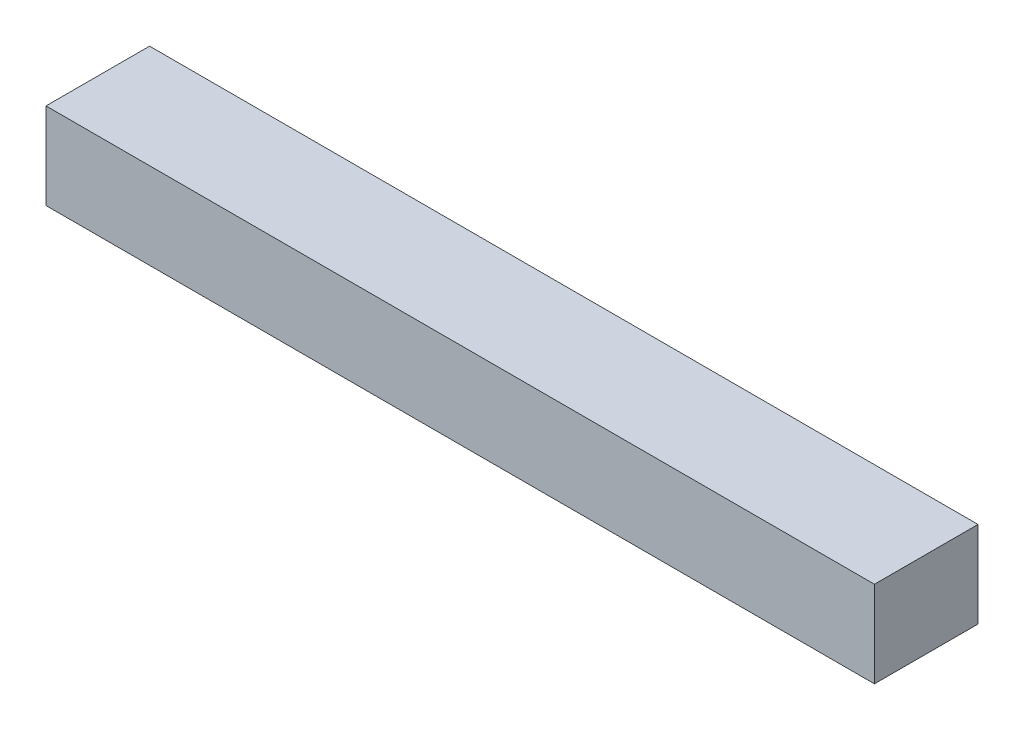
ISO-10303-21;
HEADER;
FILE_DESCRIPTION(('STEP AP214'),'2;1');
FILE_NAME('part.step','',(''),(''),'','','');
FILE_SCHEMA(('AUTOMOTIVE_DESIGN { 1 0 10303 214 1 1 1 1 }'));
ENDSEC;
DATA;
#1=APPLICATION_CONTEXT('core data for automotive mechanical design processes');
#2=APPLICATION_PROTOCOL_DEFINITION('international standard','automotive_design',2000,#1);
#3=PRODUCT_CONTEXT('',#1,'mechanical');
#4=PRODUCT('Part','Part','',(#3));
#5=PRODUCT_RELATED_PRODUCT_CATEGORY('part','',(#4));
#6=PRODUCT_DEFINITION_FORMATION('','',#4);
#7=PRODUCT_DEFINITION_CONTEXT('part definition',#1,'design');
#8=PRODUCT_DEFINITION('design','',#6,#7);
#9=PRODUCT_DEFINITION_SHAPE('','',#8);
#10=(LENGTH_UNIT() NAMED_UNIT(*) SI_UNIT(.MILLI.,.METRE.));
#11=(NAMED_UNIT(*) PLANE_ANGLE_UNIT() SI_UNIT($,.RADIAN.));
#12=(NAMED_UNIT(*) SI_UNIT($,.STERADIAN.) SOLID_ANGLE_UNIT());
#13=UNCERTAINTY_MEASURE_WITH_UNIT(LENGTH_MEASURE(1.E-05),#10,'distance_accuracy_value','');
#14=(GEOMETRIC_REPRESENTATION_CONTEXT(3) GLOBAL_UNCERTAINTY_ASSIGNED_CONTEXT((#13)) GLOBAL_UNIT_ASSIGNED_CONTEXT((#10,
#11,#12)) REPRESENTATION_CONTEXT('',''));
#15=CARTESIAN_POINT('',(0.,0.,0.));
#16=DIRECTION('',(0.,0.,1.));
#17=DIRECTION('',(1.,0.,0.));
#18=AXIS2_PLACEMENT_3D('',#15,#16,#17);
#19=CARTESIAN_POINT('',(0.,0.,38.1));
#20=DIRECTION('',(1.,0.,0.));
#21=DIRECTION('',(0.,0.,-1.));
#22=AXIS2_PLACEMENT_3D('',#19,#20,#21);
#23=PLANE('',#22);
#24=DIRECTION('',(0.,-1.,0.));
#25=VECTOR('',#24,1.);
#26=CARTESIAN_POINT('',(0.,0.,0.));
#27=LINE('',#26,#25);
#28=CARTESIAN_POINT('',(0.,31.75,0.));
#29=VERTEX_POINT('',#28);
#30=CARTESIAN_POINT('',(0.,0.,0.));
#31=VERTEX_POINT('',#30);
#32=EDGE_CURVE('E107',#29,#31,#27,.T.);
#33=ORIENTED_EDGE('',*,*,#32,.T.);
#34=DIRECTION('',(0.,0.,-1.));
#35=VECTOR('',#34,1.);
#36=CARTESIAN_POINT('',(0.,0.,38.1));
#37=LINE('',#36,#35);
#38=CARTESIAN_POINT('',(0.,0.,38.1));
#39=VERTEX_POINT('',#38);
#40=EDGE_CURVE('E11',#39,#31,#37,.T.);
#41=ORIENTED_EDGE('',*,*,#40,.F.);
#42=DIRECTION('',(0.,-1.,0.));
#43=VECTOR('',#42,1.);
#44=CARTESIAN_POINT('',(0.,0.,38.1));
#45=LINE('',#44,#43);
#46=CARTESIAN_POINT('',(0.,31.75,38.1));
#47=VERTEX_POINT('',#46);
#48=EDGE_CURVE('E91',#47,#39,#45,.T.);
#49=ORIENTED_EDGE('',*,*,#48,.F.);
#50=DIRECTION('',(0.,0.,-1.));
#51=VECTOR('',#50,1.);
#52=CARTESIAN_POINT('',(0.,31.75,38.1));
#53=LINE('',#52,#51);
#54=EDGE_CURVE('E103',#47,#29,#53,.T.);
#55=ORIENTED_EDGE('',*,*,#54,.T.);
#56=EDGE_LOOP('',(#33,#41,#49,#55));
#57=FACE_BOUND('',#56,.T.);
#58=ADVANCED_FACE('F39',(#57),#23,.F.);
#59=CARTESIAN_POINT('',(0.,0.,38.1));
#60=DIRECTION('',(0.,1.,0.));
#61=DIRECTION('',(0.,0.,1.));
#62=AXIS2_PLACEMENT_3D('',#59,#60,#61);
#63=PLANE('',#62);
#64=DIRECTION('',(1.,0.,0.));
#65=VECTOR('',#64,1.);
#66=CARTESIAN_POINT('',(0.,0.,0.));
#67=LINE('',#66,#65);
#68=CARTESIAN_POINT('',(304.8,0.,0.));
#69=VERTEX_POINT('',#68);
#70=EDGE_CURVE('E96',#31,#69,#67,.T.);
#71=ORIENTED_EDGE('',*,*,#70,.T.);
#72=DIRECTION('',(0.,0.,-1.));
#73=VECTOR('',#72,1.);
#74=CARTESIAN_POINT('',(304.8,0.,38.1));
#75=LINE('',#74,#73);
#76=CARTESIAN_POINT('',(304.8,0.,38.1));
#77=VERTEX_POINT('',#76);
#78=EDGE_CURVE('E48',#77,#69,#75,.T.);
#79=ORIENTED_EDGE('',*,*,#78,.F.);
#80=DIRECTION('',(1.,0.,0.));
#81=VECTOR('',#80,1.);
#82=CARTESIAN_POINT('',(0.,0.,38.1));
#83=LINE('',#82,#81);
#84=EDGE_CURVE('E86',#39,#77,#83,.T.);
#85=ORIENTED_EDGE('',*,*,#84,.F.);
#86=ORIENTED_EDGE('',*,*,#40,.T.);
#87=EDGE_LOOP('',(#71,#79,#85,#86));
#88=FACE_BOUND('',#87,.T.);
#89=ADVANCED_FACE('F95',(#88),#63,.F.);
#90=CARTESIAN_POINT('',(304.8,0.,38.1));
#91=DIRECTION('',(-1.,0.,0.));
#92=DIRECTION('',(0.,0.,1.));
#93=AXIS2_PLACEMENT_3D('',#90,#91,#92);
#94=PLANE('',#93);
#95=DIRECTION('',(0.,1.,0.));
#96=VECTOR('',#95,1.);
#97=CARTESIAN_POINT('',(304.8,0.,0.));
#98=LINE('',#97,#96);
#99=CARTESIAN_POINT('',(304.8,31.75,0.));
#100=VERTEX_POINT('',#99);
#101=EDGE_CURVE('E73',#69,#100,#98,.T.);
#102=ORIENTED_EDGE('',*,*,#101,.T.);
#103=DIRECTION('',(0.,0.,-1.));
#104=VECTOR('',#103,1.);
#105=CARTESIAN_POINT('',(304.8,31.75,38.1));
#106=LINE('',#105,#104);
#107=CARTESIAN_POINT('',(304.8,31.75,38.1));
#108=VERTEX_POINT('',#107);
#109=EDGE_CURVE('E98',#108,#100,#106,.T.);
#110=ORIENTED_EDGE('',*,*,#109,.F.);
#111=DIRECTION('',(0.,1.,0.));
#112=VECTOR('',#111,1.);
#113=CARTESIAN_POINT('',(304.8,0.,38.1));
#114=LINE('',#113,#112);
#115=EDGE_CURVE('E89',#77,#108,#114,.T.);
#116=ORIENTED_EDGE('',*,*,#115,.F.);
#117=ORIENTED_EDGE('',*,*,#78,.T.);
#118=EDGE_LOOP('',(#102,#110,#116,#117));
#119=FACE_BOUND('',#118,.T.);
#120=ADVANCED_FACE('F99',(#119),#94,.F.);
#121=CARTESIAN_POINT('',(0.,31.75,38.1));
#122=DIRECTION('',(0.,-1.,0.));
#123=DIRECTION('',(0.,0.,-1.));
#124=AXIS2_PLACEMENT_3D('',#121,#122,#123);
#125=PLANE('',#124);
#126=DIRECTION('',(-1.,0.,0.));
#127=VECTOR('',#126,1.);
#128=CARTESIAN_POINT('',(0.,31.75,0.));
#129=LINE('',#128,#127);
#130=EDGE_CURVE('E79',#100,#29,#129,.T.);
#131=ORIENTED_EDGE('',*,*,#130,.T.);
#132=ORIENTED_EDGE('',*,*,#54,.F.);
#133=DIRECTION('',(-1.,0.,0.));
#134=VECTOR('',#133,1.);
#135=CARTESIAN_POINT('',(0.,31.75,38.1));
#136=LINE('',#135,#134);
#137=EDGE_CURVE('E56',#108,#47,#136,.T.);
#138=ORIENTED_EDGE('',*,*,#137,.F.);
#139=ORIENTED_EDGE('',*,*,#109,.T.);
#140=EDGE_LOOP('',(#131,#132,#138,#139));
#141=FACE_BOUND('',#140,.T.);
#142=ADVANCED_FACE('F120',(#141),#125,.F.);
#143=CARTESIAN_POINT('',(0.,0.,38.1));
#144=DIRECTION('',(0.,0.,-1.));
#145=DIRECTION('',(-1.,0.,0.));
#146=AXIS2_PLACEMENT_3D('',#143,#144,#145);
#147=PLANE('',#146);
#148=ORIENTED_EDGE('',*,*,#48,.T.);
#149=ORIENTED_EDGE('',*,*,#84,.T.);
#150=ORIENTED_EDGE('',*,*,#115,.T.);
#151=ORIENTED_EDGE('',*,*,#137,.T.);
#152=EDGE_LOOP('',(#148,#149,#150,#151));
#153=FACE_BOUND('',#152,.T.);
#154=ADVANCED_FACE('F87',(#153),#147,.F.);
#155=CARTESIAN_POINT('',(0.,0.,0.));
#156=DIRECTION('',(0.,0.,-1.));
#157=DIRECTION('',(-1.,0.,0.));
#158=AXIS2_PLACEMENT_3D('',#155,#156,#157);
#159=PLANE('',#158);
#160=ORIENTED_EDGE('',*,*,#32,.F.);
#161=ORIENTED_EDGE('',*,*,#130,.F.);
#162=ORIENTED_EDGE('',*,*,#101,.F.);
#163=ORIENTED_EDGE('',*,*,#70,.F.);
#164=EDGE_LOOP('',(#160,#161,#162,#163));
#165=FACE_BOUND('',#164,.T.);
#166=ADVANCED_FACE('F123',(#165),#159,.T.);
#167=CLOSED_SHELL('',(#58,#89,#120,#142,#154,#166));
#168=MANIFOLD_SOLID_BREP('B2',#167);
#169=ADVANCED_BREP_SHAPE_REPRESENTATION('',(#18,#168),#14);
#170=SHAPE_DEFINITION_REPRESENTATION(#9,#169);
ENDSEC;
END-ISO-10303-21;
